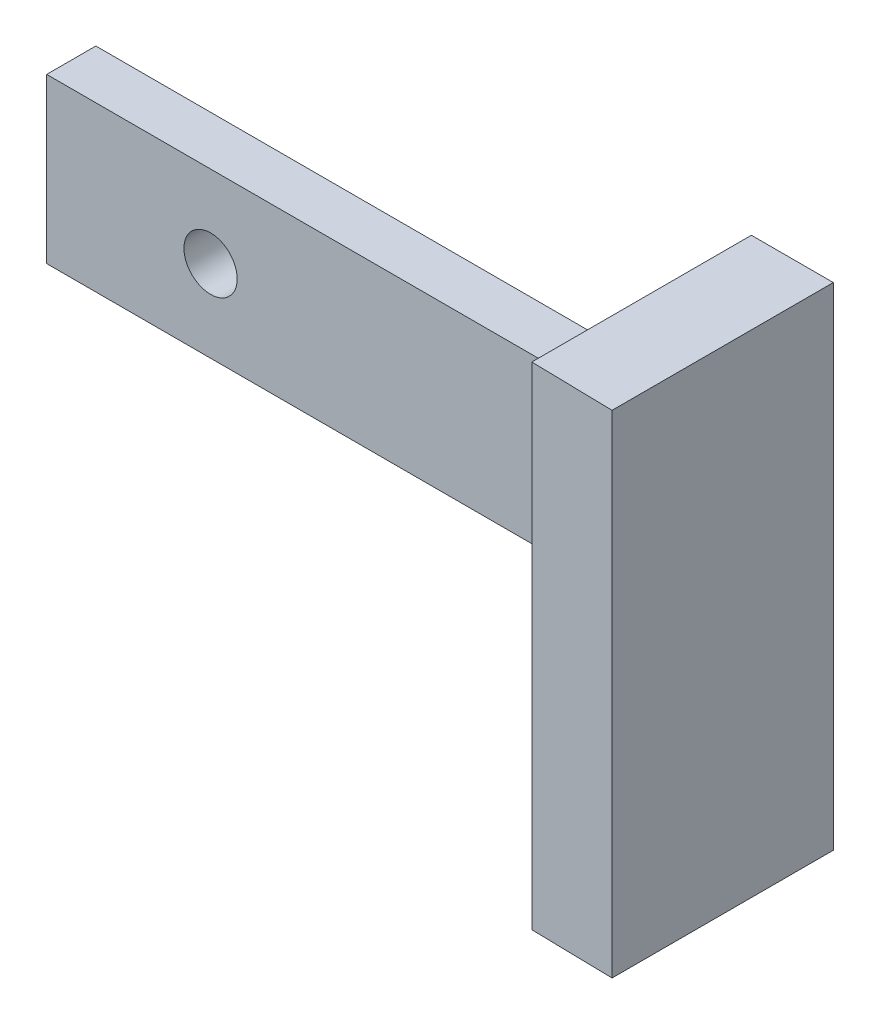
ISO-10303-21;
HEADER;
FILE_DESCRIPTION(('STEP AP214'),'2;1');
FILE_NAME('part.step','',(''),(''),'','','');
FILE_SCHEMA(('AUTOMOTIVE_DESIGN { 1 0 10303 214 1 1 1 1 }'));
ENDSEC;
DATA;
#1=APPLICATION_CONTEXT('core data for automotive mechanical design processes');
#2=APPLICATION_PROTOCOL_DEFINITION('international standard','automotive_design',2000,#1);
#3=PRODUCT_CONTEXT('',#1,'mechanical');
#4=PRODUCT('Part','Part','',(#3));
#5=PRODUCT_RELATED_PRODUCT_CATEGORY('part','',(#4));
#6=PRODUCT_DEFINITION_FORMATION('','',#4);
#7=PRODUCT_DEFINITION_CONTEXT('part definition',#1,'design');
#8=PRODUCT_DEFINITION('design','',#6,#7);
#9=PRODUCT_DEFINITION_SHAPE('','',#8);
#10=(LENGTH_UNIT() NAMED_UNIT(*) SI_UNIT(.MILLI.,.METRE.));
#11=(NAMED_UNIT(*) PLANE_ANGLE_UNIT() SI_UNIT($,.RADIAN.));
#12=(NAMED_UNIT(*) SI_UNIT($,.STERADIAN.) SOLID_ANGLE_UNIT());
#13=UNCERTAINTY_MEASURE_WITH_UNIT(LENGTH_MEASURE(1.E-05),#10,'distance_accuracy_value','');
#14=(GEOMETRIC_REPRESENTATION_CONTEXT(3) GLOBAL_UNCERTAINTY_ASSIGNED_CONTEXT((#13)) GLOBAL_UNIT_ASSIGNED_CONTEXT((#10,
#11,#12)) REPRESENTATION_CONTEXT('',''));
#15=CARTESIAN_POINT('',(0.,0.,0.));
#16=DIRECTION('',(0.,0.,1.));
#17=DIRECTION('',(1.,0.,0.));
#18=AXIS2_PLACEMENT_3D('',#15,#16,#17);
#19=CARTESIAN_POINT('',(-5.,0.,3.));
#20=DIRECTION('',(1.,0.,0.));
#21=DIRECTION('',(0.,1.,0.));
#22=AXIS2_PLACEMENT_3D('',#19,#20,#21);
#23=PLANE('',#22);
#24=DIRECTION('',(0.,-1.,0.));
#25=VECTOR('',#24,1.);
#26=CARTESIAN_POINT('',(-5.,0.,0.));
#27=LINE('',#26,#25);
#28=CARTESIAN_POINT('',(-5.,0.,0.));
#29=VERTEX_POINT('',#28);
#30=CARTESIAN_POINT('',(-5.,-10.,0.));
#31=VERTEX_POINT('',#30);
#32=EDGE_CURVE('E82',#29,#31,#27,.T.);
#33=ORIENTED_EDGE('',*,*,#32,.T.);
#34=DIRECTION('',(0.,0.,-1.));
#35=VECTOR('',#34,1.);
#36=CARTESIAN_POINT('',(-5.,-10.,3.));
#37=LINE('',#36,#35);
#38=CARTESIAN_POINT('',(-5.,-10.,3.));
#39=VERTEX_POINT('',#38);
#40=EDGE_CURVE('E36',#39,#31,#37,.T.);
#41=ORIENTED_EDGE('',*,*,#40,.F.);
#42=DIRECTION('',(0.,-1.,0.));
#43=VECTOR('',#42,1.);
#44=CARTESIAN_POINT('',(-5.,0.,3.));
#45=LINE('',#44,#43);
#46=CARTESIAN_POINT('',(-5.,0.,3.));
#47=VERTEX_POINT('',#46);
#48=EDGE_CURVE('E76',#47,#39,#45,.T.);
#49=ORIENTED_EDGE('',*,*,#48,.F.);
#50=DIRECTION('',(0.,0.,-1.));
#51=VECTOR('',#50,1.);
#52=CARTESIAN_POINT('',(-5.,0.,3.));
#53=LINE('',#52,#51);
#54=EDGE_CURVE('E69',#47,#29,#53,.T.);
#55=ORIENTED_EDGE('',*,*,#54,.T.);
#56=EDGE_LOOP('',(#33,#41,#49,#55));
#57=FACE_BOUND('',#56,.T.);
#58=ADVANCED_FACE('F33',(#57),#23,.F.);
#59=CARTESIAN_POINT('',(-5.,-10.,3.));
#60=DIRECTION('',(0.,1.,0.));
#61=DIRECTION('',(-1.,0.,0.));
#62=AXIS2_PLACEMENT_3D('',#59,#60,#61);
#63=PLANE('',#62);
#64=DIRECTION('',(1.,0.,0.));
#65=VECTOR('',#64,1.);
#66=CARTESIAN_POINT('',(-5.,-10.,0.));
#67=LINE('',#66,#65);
#68=CARTESIAN_POINT('',(35.,-10.,0.));
#69=VERTEX_POINT('',#68);
#70=EDGE_CURVE('E86',#31,#69,#67,.T.);
#71=ORIENTED_EDGE('',*,*,#70,.T.);
#72=DIRECTION('',(0.,0.,1.));
#73=VECTOR('',#72,1.);
#74=CARTESIAN_POINT('',(35.,-10.,3.));
#75=LINE('',#74,#73);
#76=CARTESIAN_POINT('',(35.,-10.,3.));
#77=VERTEX_POINT('',#76);
#78=EDGE_CURVE('E137',#69,#77,#75,.T.);
#79=ORIENTED_EDGE('',*,*,#78,.T.);
#80=DIRECTION('',(1.,0.,0.));
#81=VECTOR('',#80,1.);
#82=CARTESIAN_POINT('',(-5.,-10.,3.));
#83=LINE('',#82,#81);
#84=EDGE_CURVE('E148',#39,#77,#83,.T.);
#85=ORIENTED_EDGE('',*,*,#84,.F.);
#86=ORIENTED_EDGE('',*,*,#40,.T.);
#87=EDGE_LOOP('',(#71,#79,#85,#86));
#88=FACE_BOUND('',#87,.T.);
#89=ADVANCED_FACE('F191',(#88),#63,.F.);
#90=CARTESIAN_POINT('',(40.,0.,3.));
#91=DIRECTION('',(-1.,0.,0.));
#92=DIRECTION('',(0.,-1.,0.));
#93=AXIS2_PLACEMENT_3D('',#90,#91,#92);
#94=PLANE('',#93);
#95=DIRECTION('',(0.,1.,0.));
#96=VECTOR('',#95,1.);
#97=CARTESIAN_POINT('',(40.,0.,0.));
#98=LINE('',#97,#96);
#99=CARTESIAN_POINT('',(40.,-20.,0.));
#100=VERTEX_POINT('',#99);
#101=CARTESIAN_POINT('',(40.,10.,0.));
#102=VERTEX_POINT('',#101);
#103=EDGE_CURVE('E77',#100,#102,#98,.T.);
#104=ORIENTED_EDGE('',*,*,#103,.T.);
#105=DIRECTION('',(0.,0.,1.));
#106=VECTOR('',#105,1.);
#107=CARTESIAN_POINT('',(40.,10.,3.));
#108=LINE('',#107,#106);
#109=CARTESIAN_POINT('',(40.,10.,13.5));
#110=VERTEX_POINT('',#109);
#111=EDGE_CURVE('E107',#102,#110,#108,.T.);
#112=ORIENTED_EDGE('',*,*,#111,.T.);
#113=DIRECTION('',(0.,1.,0.));
#114=VECTOR('',#113,1.);
#115=CARTESIAN_POINT('',(40.,10.,13.5));
#116=LINE('',#115,#114);
#117=CARTESIAN_POINT('',(40.,-20.,13.5));
#118=VERTEX_POINT('',#117);
#119=EDGE_CURVE('E178',#118,#110,#116,.T.);
#120=ORIENTED_EDGE('',*,*,#119,.F.);
#121=DIRECTION('',(0.,0.,1.));
#122=VECTOR('',#121,1.);
#123=CARTESIAN_POINT('',(40.,-20.,3.));
#124=LINE('',#123,#122);
#125=EDGE_CURVE('E110',#100,#118,#124,.T.);
#126=ORIENTED_EDGE('',*,*,#125,.F.);
#127=EDGE_LOOP('',(#104,#112,#120,#126));
#128=FACE_BOUND('',#127,.T.);
#129=ADVANCED_FACE('F104',(#128),#94,.F.);
#130=CARTESIAN_POINT('',(-5.,0.,3.));
#131=DIRECTION('',(0.,-1.,0.));
#132=DIRECTION('',(0.,0.,-1.));
#133=AXIS2_PLACEMENT_3D('',#130,#131,#132);
#134=PLANE('',#133);
#135=DIRECTION('',(-1.,0.,0.));
#136=VECTOR('',#135,1.);
#137=CARTESIAN_POINT('',(-5.,0.,3.));
#138=LINE('',#137,#136);
#139=CARTESIAN_POINT('',(35.,0.,3.));
#140=VERTEX_POINT('',#139);
#141=EDGE_CURVE('E52',#140,#47,#138,.T.);
#142=ORIENTED_EDGE('',*,*,#141,.F.);
#143=DIRECTION('',(0.,0.,-1.));
#144=VECTOR('',#143,1.);
#145=CARTESIAN_POINT('',(35.,0.,3.));
#146=LINE('',#145,#144);
#147=CARTESIAN_POINT('',(35.,0.,0.));
#148=VERTEX_POINT('',#147);
#149=EDGE_CURVE('E72',#140,#148,#146,.T.);
#150=ORIENTED_EDGE('',*,*,#149,.T.);
#151=DIRECTION('',(-1.,0.,0.));
#152=VECTOR('',#151,1.);
#153=CARTESIAN_POINT('',(-5.,0.,0.));
#154=LINE('',#153,#152);
#155=EDGE_CURVE('E66',#148,#29,#154,.T.);
#156=ORIENTED_EDGE('',*,*,#155,.T.);
#157=ORIENTED_EDGE('',*,*,#54,.F.);
#158=EDGE_LOOP('',(#142,#150,#156,#157));
#159=FACE_BOUND('',#158,.T.);
#160=ADVANCED_FACE('F68',(#159),#134,.F.);
#161=CARTESIAN_POINT('',(0.,0.,3.));
#162=DIRECTION('',(0.,0.,1.));
#163=DIRECTION('',(1.,0.,0.));
#164=AXIS2_PLACEMENT_3D('',#161,#162,#163);
#165=PLANE('',#164);
#166=DIRECTION('',(0.,-1.,0.));
#167=VECTOR('',#166,1.);
#168=CARTESIAN_POINT('',(35.,10.,3.));
#169=LINE('',#168,#167);
#170=EDGE_CURVE('E11',#140,#77,#169,.T.);
#171=ORIENTED_EDGE('',*,*,#170,.F.);
#172=ORIENTED_EDGE('',*,*,#141,.T.);
#173=ORIENTED_EDGE('',*,*,#48,.T.);
#174=ORIENTED_EDGE('',*,*,#84,.T.);
#175=EDGE_LOOP('',(#171,#172,#173,#174));
#176=FACE_BOUND('',#175,.T.);
#177=CARTESIAN_POINT('',(30.,-5.,3.));
#178=DIRECTION('',(0.,0.,1.));
#179=DIRECTION('',(1.,0.,0.));
#180=AXIS2_PLACEMENT_3D('',#177,#178,#179);
#181=CIRCLE('',#180,1.62500000000001);
#182=CARTESIAN_POINT('',(31.625,-5.,3.));
#183=VERTEX_POINT('',#182);
#184=EDGE_CURVE('E92',#183,#183,#181,.T.);
#185=ORIENTED_EDGE('',*,*,#184,.F.);
#186=EDGE_LOOP('',(#185));
#187=FACE_BOUND('',#186,.T.);
#188=CARTESIAN_POINT('',(5.,-5.,3.));
#189=DIRECTION('',(0.,0.,1.));
#190=DIRECTION('',(1.,0.,0.));
#191=AXIS2_PLACEMENT_3D('',#188,#189,#190);
#192=CIRCLE('',#191,1.625);
#193=CARTESIAN_POINT('',(6.62500000000001,-5.,3.));
#194=VERTEX_POINT('',#193);
#195=EDGE_CURVE('E139',#194,#194,#192,.T.);
#196=ORIENTED_EDGE('',*,*,#195,.F.);
#197=EDGE_LOOP('',(#196));
#198=FACE_BOUND('',#197,.T.);
#199=ADVANCED_FACE('F149',(#176,#187,#198),#165,.T.);
#200=CARTESIAN_POINT('',(0.,0.,0.));
#201=DIRECTION('',(0.,0.,1.));
#202=DIRECTION('',(1.,0.,0.));
#203=AXIS2_PLACEMENT_3D('',#200,#201,#202);
#204=PLANE('',#203);
#205=CARTESIAN_POINT('',(30.,-5.,0.));
#206=DIRECTION('',(0.,0.,1.));
#207=DIRECTION('',(1.,0.,0.));
#208=AXIS2_PLACEMENT_3D('',#205,#206,#207);
#209=CIRCLE('',#208,1.62500000000001);
#210=CARTESIAN_POINT('',(31.625,-5.,0.));
#211=VERTEX_POINT('',#210);
#212=EDGE_CURVE('E88',#211,#211,#209,.T.);
#213=ORIENTED_EDGE('',*,*,#212,.T.);
#214=EDGE_LOOP('',(#213));
#215=FACE_BOUND('',#214,.T.);
#216=CARTESIAN_POINT('',(5.,-5.,0.));
#217=DIRECTION('',(0.,0.,1.));
#218=DIRECTION('',(1.,0.,0.));
#219=AXIS2_PLACEMENT_3D('',#216,#217,#218);
#220=CIRCLE('',#219,1.625);
#221=CARTESIAN_POINT('',(6.62500000000001,-5.,0.));
#222=VERTEX_POINT('',#221);
#223=EDGE_CURVE('E143',#222,#222,#220,.T.);
#224=ORIENTED_EDGE('',*,*,#223,.T.);
#225=EDGE_LOOP('',(#224));
#226=FACE_BOUND('',#225,.T.);
#227=ORIENTED_EDGE('',*,*,#155,.F.);
#228=DIRECTION('',(0.,-1.,0.));
#229=VECTOR('',#228,1.);
#230=CARTESIAN_POINT('',(35.,10.,0.));
#231=LINE('',#230,#229);
#232=CARTESIAN_POINT('',(35.,10.,0.));
#233=VERTEX_POINT('',#232);
#234=EDGE_CURVE('E128',#233,#148,#231,.T.);
#235=ORIENTED_EDGE('',*,*,#234,.F.);
#236=DIRECTION('',(1.,0.,0.));
#237=VECTOR('',#236,1.);
#238=CARTESIAN_POINT('',(40.,10.,0.));
#239=LINE('',#238,#237);
#240=EDGE_CURVE('E121',#233,#102,#239,.T.);
#241=ORIENTED_EDGE('',*,*,#240,.T.);
#242=ORIENTED_EDGE('',*,*,#103,.F.);
#243=DIRECTION('',(1.,0.,0.));
#244=VECTOR('',#243,1.);
#245=CARTESIAN_POINT('',(40.,-20.,0.));
#246=LINE('',#245,#244);
#247=CARTESIAN_POINT('',(35.,-20.,0.));
#248=VERTEX_POINT('',#247);
#249=EDGE_CURVE('E125',#248,#100,#246,.T.);
#250=ORIENTED_EDGE('',*,*,#249,.F.);
#251=EDGE_CURVE('E129',#69,#248,#231,.T.);
#252=ORIENTED_EDGE('',*,*,#251,.F.);
#253=ORIENTED_EDGE('',*,*,#70,.F.);
#254=ORIENTED_EDGE('',*,*,#32,.F.);
#255=EDGE_LOOP('',(#227,#235,#241,#242,#250,#252,#253,#254));
#256=FACE_BOUND('',#255,.T.);
#257=ADVANCED_FACE('F83',(#215,#226,#256),#204,.F.);
#258=CARTESIAN_POINT('',(5.,-5.,0.));
#259=DIRECTION('',(0.,0.,1.));
#260=DIRECTION('',(1.,0.,0.));
#261=AXIS2_PLACEMENT_3D('',#258,#259,#260);
#262=CYLINDRICAL_SURFACE('',#261,1.625);
#263=ORIENTED_EDGE('',*,*,#223,.F.);
#264=EDGE_LOOP('',(#263));
#265=FACE_BOUND('',#264,.T.);
#266=ORIENTED_EDGE('',*,*,#195,.T.);
#267=EDGE_LOOP('',(#266));
#268=FACE_BOUND('',#267,.T.);
#269=ADVANCED_FACE('F203',(#265,#268),#262,.F.);
#270=CARTESIAN_POINT('',(30.,-5.,0.));
#271=DIRECTION('',(0.,0.,1.));
#272=DIRECTION('',(1.,0.,0.));
#273=AXIS2_PLACEMENT_3D('',#270,#271,#272);
#274=CYLINDRICAL_SURFACE('',#273,1.62500000000001);
#275=ORIENTED_EDGE('',*,*,#212,.F.);
#276=EDGE_LOOP('',(#275));
#277=FACE_BOUND('',#276,.T.);
#278=ORIENTED_EDGE('',*,*,#184,.T.);
#279=EDGE_LOOP('',(#278));
#280=FACE_BOUND('',#279,.T.);
#281=ADVANCED_FACE('F209',(#277,#280),#274,.F.);
#282=CARTESIAN_POINT('',(0.,10.,0.));
#283=DIRECTION('',(0.,1.,0.));
#284=DIRECTION('',(0.,0.,1.));
#285=AXIS2_PLACEMENT_3D('',#282,#283,#284);
#286=PLANE('',#285);
#287=DIRECTION('',(0.999800059980007,0.,0.0199960011996));
#288=VECTOR('',#287,1.);
#289=CARTESIAN_POINT('',(40.,10.,13.5));
#290=LINE('',#289,#288);
#291=CARTESIAN_POINT('',(35.,10.,13.4));
#292=VERTEX_POINT('',#291);
#293=EDGE_CURVE('E123',#292,#110,#290,.T.);
#294=ORIENTED_EDGE('',*,*,#293,.T.);
#295=ORIENTED_EDGE('',*,*,#111,.F.);
#296=ORIENTED_EDGE('',*,*,#240,.F.);
#297=DIRECTION('',(0.,0.,-1.));
#298=VECTOR('',#297,1.);
#299=CARTESIAN_POINT('',(35.,10.,3.));
#300=LINE('',#299,#298);
#301=EDGE_CURVE('E124',#292,#233,#300,.T.);
#302=ORIENTED_EDGE('',*,*,#301,.F.);
#303=EDGE_LOOP('',(#294,#295,#296,#302));
#304=FACE_BOUND('',#303,.T.);
#305=ADVANCED_FACE('F119',(#304),#286,.T.);
#306=CARTESIAN_POINT('',(35.,10.,3.));
#307=DIRECTION('',(-1.,0.,0.));
#308=DIRECTION('',(0.,-1.,0.));
#309=AXIS2_PLACEMENT_3D('',#306,#307,#308);
#310=PLANE('',#309);
#311=DIRECTION('',(0.,-1.,0.));
#312=VECTOR('',#311,1.);
#313=CARTESIAN_POINT('',(35.,10.,13.4));
#314=LINE('',#313,#312);
#315=CARTESIAN_POINT('',(35.,-20.,13.4));
#316=VERTEX_POINT('',#315);
#317=EDGE_CURVE('E176',#292,#316,#314,.T.);
#318=ORIENTED_EDGE('',*,*,#317,.F.);
#319=ORIENTED_EDGE('',*,*,#301,.T.);
#320=ORIENTED_EDGE('',*,*,#234,.T.);
#321=ORIENTED_EDGE('',*,*,#149,.F.);
#322=ORIENTED_EDGE('',*,*,#170,.T.);
#323=ORIENTED_EDGE('',*,*,#78,.F.);
#324=ORIENTED_EDGE('',*,*,#251,.T.);
#325=DIRECTION('',(0.,0.,-1.));
#326=VECTOR('',#325,1.);
#327=CARTESIAN_POINT('',(35.,-20.,3.));
#328=LINE('',#327,#326);
#329=EDGE_CURVE('E182',#316,#248,#328,.T.);
#330=ORIENTED_EDGE('',*,*,#329,.F.);
#331=EDGE_LOOP('',(#318,#319,#320,#321,#322,#323,#324,#330));
#332=FACE_BOUND('',#331,.T.);
#333=ADVANCED_FACE('F156',(#332),#310,.T.);
#334=CARTESIAN_POINT('',(0.,-20.,0.));
#335=DIRECTION('',(0.,1.,0.));
#336=DIRECTION('',(0.,0.,1.));
#337=AXIS2_PLACEMENT_3D('',#334,#335,#336);
#338=PLANE('',#337);
#339=ORIENTED_EDGE('',*,*,#125,.T.);
#340=DIRECTION('',(0.999800059980007,0.,0.0199960011996));
#341=VECTOR('',#340,1.);
#342=CARTESIAN_POINT('',(40.,-20.,13.5));
#343=LINE('',#342,#341);
#344=EDGE_CURVE('E179',#316,#118,#343,.T.);
#345=ORIENTED_EDGE('',*,*,#344,.F.);
#346=ORIENTED_EDGE('',*,*,#329,.T.);
#347=ORIENTED_EDGE('',*,*,#249,.T.);
#348=EDGE_LOOP('',(#339,#345,#346,#347));
#349=FACE_BOUND('',#348,.T.);
#350=ADVANCED_FACE('F190',(#349),#338,.F.);
#351=CARTESIAN_POINT('',(40.,10.,13.5));
#352=DIRECTION('',(0.0199960011996,0.,-0.999800059980007));
#353=DIRECTION('',(-0.999800059980007,0.,-0.0199960011996));
#354=AXIS2_PLACEMENT_3D('',#351,#352,#353);
#355=PLANE('',#354);
#356=ORIENTED_EDGE('',*,*,#344,.T.);
#357=ORIENTED_EDGE('',*,*,#119,.T.);
#358=ORIENTED_EDGE('',*,*,#293,.F.);
#359=ORIENTED_EDGE('',*,*,#317,.T.);
#360=EDGE_LOOP('',(#356,#357,#358,#359));
#361=FACE_BOUND('',#360,.T.);
#362=ADVANCED_FACE('F175',(#361),#355,.F.);
#363=CLOSED_SHELL('',(#58,#89,#129,#160,#199,#257,#269,#281,#305,#333,#350,#362));
#364=MANIFOLD_SOLID_BREP('B2',#363);
#365=ADVANCED_BREP_SHAPE_REPRESENTATION('',(#18,#364),#14);
#366=SHAPE_DEFINITION_REPRESENTATION(#9,#365);
ENDSEC;
END-ISO-10303-21;
